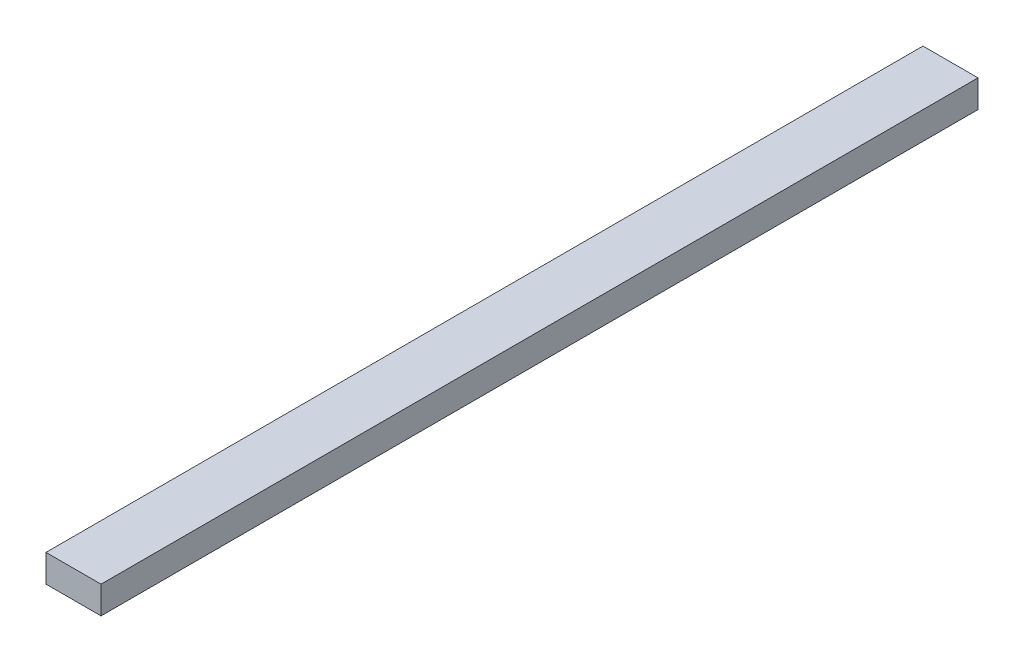
ISO-10303-21;
HEADER;
FILE_DESCRIPTION(('STEP AP214'),'2;1');
FILE_NAME('part.step','',(''),(''),'','','');
FILE_SCHEMA(('AUTOMOTIVE_DESIGN { 1 0 10303 214 1 1 1 1 }'));
ENDSEC;
DATA;
#1=APPLICATION_CONTEXT('core data for automotive mechanical design processes');
#2=APPLICATION_PROTOCOL_DEFINITION('international standard','automotive_design',2000,#1);
#3=PRODUCT_CONTEXT('',#1,'mechanical');
#4=PRODUCT('Part','Part','',(#3));
#5=PRODUCT_RELATED_PRODUCT_CATEGORY('part','',(#4));
#6=PRODUCT_DEFINITION_FORMATION('','',#4);
#7=PRODUCT_DEFINITION_CONTEXT('part definition',#1,'design');
#8=PRODUCT_DEFINITION('design','',#6,#7);
#9=PRODUCT_DEFINITION_SHAPE('','',#8);
#10=(LENGTH_UNIT() NAMED_UNIT(*) SI_UNIT(.MILLI.,.METRE.));
#11=(NAMED_UNIT(*) PLANE_ANGLE_UNIT() SI_UNIT($,.RADIAN.));
#12=(NAMED_UNIT(*) SI_UNIT($,.STERADIAN.) SOLID_ANGLE_UNIT());
#13=UNCERTAINTY_MEASURE_WITH_UNIT(LENGTH_MEASURE(1.E-05),#10,'distance_accuracy_value','');
#14=(GEOMETRIC_REPRESENTATION_CONTEXT(3) GLOBAL_UNCERTAINTY_ASSIGNED_CONTEXT((#13)) GLOBAL_UNIT_ASSIGNED_CONTEXT((#10,
#11,#12)) REPRESENTATION_CONTEXT('',''));
#15=CARTESIAN_POINT('',(0.,0.,0.));
#16=DIRECTION('',(0.,0.,1.));
#17=DIRECTION('',(1.,0.,0.));
#18=AXIS2_PLACEMENT_3D('',#15,#16,#17);
#19=CARTESIAN_POINT('',(-23.9097744360902,22.6315789473684,1275.));
#20=DIRECTION('',(1.,0.,0.));
#21=DIRECTION('',(0.,0.,-1.));
#22=AXIS2_PLACEMENT_3D('',#19,#20,#21);
#23=PLANE('',#22);
#24=DIRECTION('',(0.,-1.,0.));
#25=VECTOR('',#24,1.);
#26=CARTESIAN_POINT('',(-23.9097744360902,22.6315789473684,0.));
#27=LINE('',#26,#25);
#28=CARTESIAN_POINT('',(-23.9097744360902,22.6315789473684,0.));
#29=VERTEX_POINT('',#28);
#30=CARTESIAN_POINT('',(-23.9097744360902,-17.3684210526316,0.));
#31=VERTEX_POINT('',#30);
#32=EDGE_CURVE('E95',#29,#31,#27,.T.);
#33=ORIENTED_EDGE('',*,*,#32,.T.);
#34=DIRECTION('',(0.,0.,-1.));
#35=VECTOR('',#34,1.);
#36=CARTESIAN_POINT('',(-23.9097744360902,-17.3684210526316,1275.));
#37=LINE('',#36,#35);
#38=CARTESIAN_POINT('',(-23.9097744360902,-17.3684210526316,1275.));
#39=VERTEX_POINT('',#38);
#40=EDGE_CURVE('E11',#39,#31,#37,.T.);
#41=ORIENTED_EDGE('',*,*,#40,.F.);
#42=DIRECTION('',(0.,-1.,0.));
#43=VECTOR('',#42,1.);
#44=CARTESIAN_POINT('',(-23.9097744360902,22.6315789473684,1275.));
#45=LINE('',#44,#43);
#46=CARTESIAN_POINT('',(-23.9097744360902,22.6315789473684,1275.));
#47=VERTEX_POINT('',#46);
#48=EDGE_CURVE('E83',#47,#39,#45,.T.);
#49=ORIENTED_EDGE('',*,*,#48,.F.);
#50=DIRECTION('',(0.,0.,-1.));
#51=VECTOR('',#50,1.);
#52=CARTESIAN_POINT('',(-23.9097744360902,22.6315789473684,1275.));
#53=LINE('',#52,#51);
#54=EDGE_CURVE('E91',#47,#29,#53,.T.);
#55=ORIENTED_EDGE('',*,*,#54,.T.);
#56=EDGE_LOOP('',(#33,#41,#49,#55));
#57=FACE_BOUND('',#56,.T.);
#58=ADVANCED_FACE('F32',(#57),#23,.F.);
#59=CARTESIAN_POINT('',(-23.9097744360902,-17.3684210526316,1275.));
#60=DIRECTION('',(0.,1.,0.));
#61=DIRECTION('',(0.,0.,1.));
#62=AXIS2_PLACEMENT_3D('',#59,#60,#61);
#63=PLANE('',#62);
#64=DIRECTION('',(1.,0.,0.));
#65=VECTOR('',#64,1.);
#66=CARTESIAN_POINT('',(-23.9097744360902,-17.3684210526316,0.));
#67=LINE('',#66,#65);
#68=CARTESIAN_POINT('',(56.0902255639098,-17.3684210526316,0.));
#69=VERTEX_POINT('',#68);
#70=EDGE_CURVE('E87',#31,#69,#67,.T.);
#71=ORIENTED_EDGE('',*,*,#70,.T.);
#72=DIRECTION('',(0.,0.,-1.));
#73=VECTOR('',#72,1.);
#74=CARTESIAN_POINT('',(56.0902255639098,-17.3684210526316,1275.));
#75=LINE('',#74,#73);
#76=CARTESIAN_POINT('',(56.0902255639098,-17.3684210526316,1275.));
#77=VERTEX_POINT('',#76);
#78=EDGE_CURVE('E40',#77,#69,#75,.T.);
#79=ORIENTED_EDGE('',*,*,#78,.F.);
#80=DIRECTION('',(1.,0.,0.));
#81=VECTOR('',#80,1.);
#82=CARTESIAN_POINT('',(-23.9097744360902,-17.3684210526316,1275.));
#83=LINE('',#82,#81);
#84=EDGE_CURVE('E78',#39,#77,#83,.T.);
#85=ORIENTED_EDGE('',*,*,#84,.F.);
#86=ORIENTED_EDGE('',*,*,#40,.T.);
#87=EDGE_LOOP('',(#71,#79,#85,#86));
#88=FACE_BOUND('',#87,.T.);
#89=ADVANCED_FACE('F86',(#88),#63,.F.);
#90=CARTESIAN_POINT('',(56.0902255639098,22.6315789473684,1275.));
#91=DIRECTION('',(-1.,0.,0.));
#92=DIRECTION('',(0.,0.,1.));
#93=AXIS2_PLACEMENT_3D('',#90,#91,#92);
#94=PLANE('',#93);
#95=DIRECTION('',(0.,1.,0.));
#96=VECTOR('',#95,1.);
#97=CARTESIAN_POINT('',(56.0902255639098,22.6315789473684,0.));
#98=LINE('',#97,#96);
#99=CARTESIAN_POINT('',(56.0902255639098,22.6315789473684,0.));
#100=VERTEX_POINT('',#99);
#101=EDGE_CURVE('E65',#69,#100,#98,.T.);
#102=ORIENTED_EDGE('',*,*,#101,.T.);
#103=DIRECTION('',(0.,0.,-1.));
#104=VECTOR('',#103,1.);
#105=CARTESIAN_POINT('',(56.0902255639098,22.6315789473684,1275.));
#106=LINE('',#105,#104);
#107=CARTESIAN_POINT('',(56.0902255639098,22.6315789473684,1275.));
#108=VERTEX_POINT('',#107);
#109=EDGE_CURVE('E88',#108,#100,#106,.T.);
#110=ORIENTED_EDGE('',*,*,#109,.F.);
#111=DIRECTION('',(0.,1.,0.));
#112=VECTOR('',#111,1.);
#113=CARTESIAN_POINT('',(56.0902255639098,22.6315789473684,1275.));
#114=LINE('',#113,#112);
#115=EDGE_CURVE('E81',#77,#108,#114,.T.);
#116=ORIENTED_EDGE('',*,*,#115,.F.);
#117=ORIENTED_EDGE('',*,*,#78,.T.);
#118=EDGE_LOOP('',(#102,#110,#116,#117));
#119=FACE_BOUND('',#118,.T.);
#120=ADVANCED_FACE('F89',(#119),#94,.F.);
#121=CARTESIAN_POINT('',(-23.9097744360902,22.6315789473684,1275.));
#122=DIRECTION('',(0.,-1.,0.));
#123=DIRECTION('',(0.,0.,-1.));
#124=AXIS2_PLACEMENT_3D('',#121,#122,#123);
#125=PLANE('',#124);
#126=DIRECTION('',(-1.,0.,0.));
#127=VECTOR('',#126,1.);
#128=CARTESIAN_POINT('',(-23.9097744360902,22.6315789473684,0.));
#129=LINE('',#128,#127);
#130=EDGE_CURVE('E71',#100,#29,#129,.T.);
#131=ORIENTED_EDGE('',*,*,#130,.T.);
#132=ORIENTED_EDGE('',*,*,#54,.F.);
#133=DIRECTION('',(-1.,0.,0.));
#134=VECTOR('',#133,1.);
#135=CARTESIAN_POINT('',(-23.9097744360902,22.6315789473684,1275.));
#136=LINE('',#135,#134);
#137=EDGE_CURVE('E48',#108,#47,#136,.T.);
#138=ORIENTED_EDGE('',*,*,#137,.F.);
#139=ORIENTED_EDGE('',*,*,#109,.T.);
#140=EDGE_LOOP('',(#131,#132,#138,#139));
#141=FACE_BOUND('',#140,.T.);
#142=ADVANCED_FACE('F102',(#141),#125,.F.);
#143=CARTESIAN_POINT('',(0.,0.,1275.));
#144=DIRECTION('',(0.,0.,1.));
#145=DIRECTION('',(1.,0.,0.));
#146=AXIS2_PLACEMENT_3D('',#143,#144,#145);
#147=PLANE('',#146);
#148=ORIENTED_EDGE('',*,*,#48,.T.);
#149=ORIENTED_EDGE('',*,*,#84,.T.);
#150=ORIENTED_EDGE('',*,*,#115,.T.);
#151=ORIENTED_EDGE('',*,*,#137,.T.);
#152=EDGE_LOOP('',(#148,#149,#150,#151));
#153=FACE_BOUND('',#152,.T.);
#154=ADVANCED_FACE('F79',(#153),#147,.T.);
#155=CARTESIAN_POINT('',(0.,0.,0.));
#156=DIRECTION('',(0.,0.,1.));
#157=DIRECTION('',(1.,0.,0.));
#158=AXIS2_PLACEMENT_3D('',#155,#156,#157);
#159=PLANE('',#158);
#160=ORIENTED_EDGE('',*,*,#32,.F.);
#161=ORIENTED_EDGE('',*,*,#130,.F.);
#162=ORIENTED_EDGE('',*,*,#101,.F.);
#163=ORIENTED_EDGE('',*,*,#70,.F.);
#164=EDGE_LOOP('',(#160,#161,#162,#163));
#165=FACE_BOUND('',#164,.T.);
#166=ADVANCED_FACE('F105',(#165),#159,.F.);
#167=CLOSED_SHELL('',(#58,#89,#120,#142,#154,#166));
#168=MANIFOLD_SOLID_BREP('B2',#167);
#169=ADVANCED_BREP_SHAPE_REPRESENTATION('',(#18,#168),#14);
#170=SHAPE_DEFINITION_REPRESENTATION(#9,#169);
ENDSEC;
END-ISO-10303-21;
